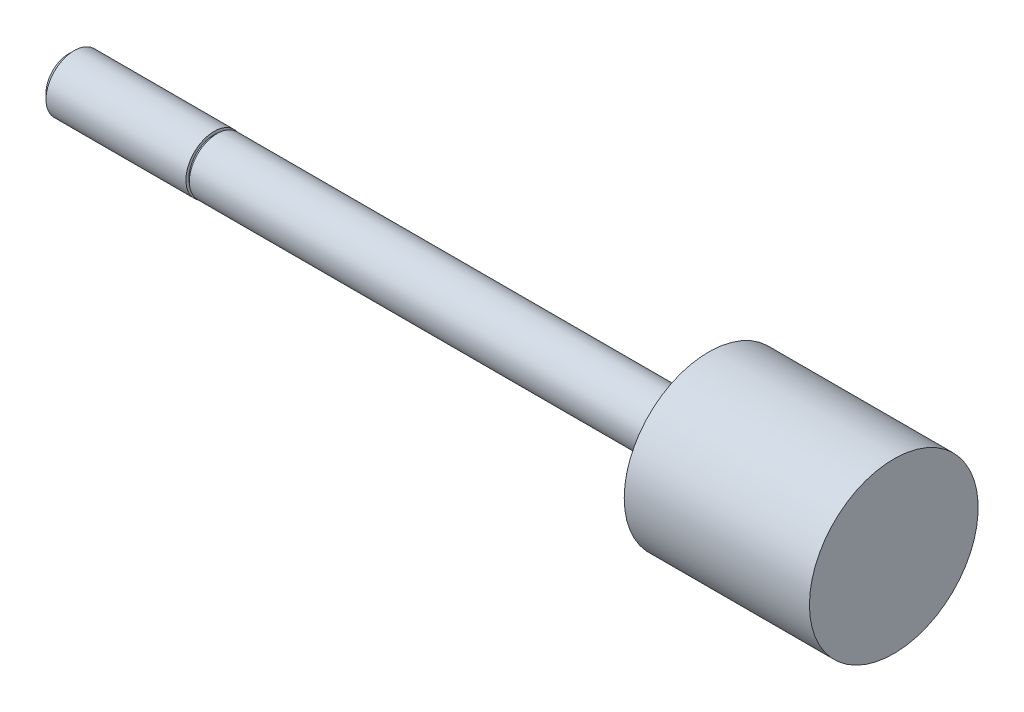
ISO-10303-21;
HEADER;
FILE_DESCRIPTION(('STEP AP214'),'2;1');
FILE_NAME('part.step','',(''),(''),'','','');
FILE_SCHEMA(('AUTOMOTIVE_DESIGN { 1 0 10303 214 1 1 1 1 }'));
ENDSEC;
DATA;
#1=APPLICATION_CONTEXT('core data for automotive mechanical design processes');
#2=APPLICATION_PROTOCOL_DEFINITION('international standard','automotive_design',2000,#1);
#3=PRODUCT_CONTEXT('',#1,'mechanical');
#4=PRODUCT('Part','Part','',(#3));
#5=PRODUCT_RELATED_PRODUCT_CATEGORY('part','',(#4));
#6=PRODUCT_DEFINITION_FORMATION('','',#4);
#7=PRODUCT_DEFINITION_CONTEXT('part definition',#1,'design');
#8=PRODUCT_DEFINITION('design','',#6,#7);
#9=PRODUCT_DEFINITION_SHAPE('','',#8);
#10=(LENGTH_UNIT() NAMED_UNIT(*) SI_UNIT(.MILLI.,.METRE.));
#11=(NAMED_UNIT(*) PLANE_ANGLE_UNIT() SI_UNIT($,.RADIAN.));
#12=(NAMED_UNIT(*) SI_UNIT($,.STERADIAN.) SOLID_ANGLE_UNIT());
#13=UNCERTAINTY_MEASURE_WITH_UNIT(LENGTH_MEASURE(1.E-05),#10,'distance_accuracy_value','');
#14=(GEOMETRIC_REPRESENTATION_CONTEXT(3) GLOBAL_UNCERTAINTY_ASSIGNED_CONTEXT((#13)) GLOBAL_UNIT_ASSIGNED_CONTEXT((#10,
#11,#12)) REPRESENTATION_CONTEXT('',''));
#15=CARTESIAN_POINT('',(0.,0.,0.));
#16=DIRECTION('',(0.,0.,1.));
#17=DIRECTION('',(1.,0.,0.));
#18=AXIS2_PLACEMENT_3D('',#15,#16,#17);
#19=CARTESIAN_POINT('',(57.912,0.,0.));
#20=DIRECTION('',(-1.,0.,0.));
#21=DIRECTION('',(0.,0.,1.));
#22=AXIS2_PLACEMENT_3D('',#19,#20,#21);
#23=CYLINDRICAL_SURFACE('',#22,2.3749);
#24=CARTESIAN_POINT('',(0.,0.,0.));
#25=DIRECTION('',(-1.,0.,0.));
#26=DIRECTION('',(0.,0.,1.));
#27=AXIS2_PLACEMENT_3D('',#24,#25,#26);
#28=CIRCLE('',#27,2.3749);
#29=CARTESIAN_POINT('',(0.,0.,2.3749));
#30=VERTEX_POINT('',#29);
#31=EDGE_CURVE('E56',#30,#30,#28,.T.);
#32=ORIENTED_EDGE('',*,*,#31,.F.);
#33=EDGE_LOOP('',(#32));
#34=FACE_BOUND('',#33,.T.);
#35=CARTESIAN_POINT('',(42.0624,0.,0.));
#36=DIRECTION('',(-1.,0.,0.));
#37=DIRECTION('',(0.,0.,1.));
#38=AXIS2_PLACEMENT_3D('',#35,#36,#37);
#39=CIRCLE('',#38,2.3749);
#40=CARTESIAN_POINT('',(42.0624,0.,2.3749));
#41=VERTEX_POINT('',#40);
#42=EDGE_CURVE('E10',#41,#41,#39,.T.);
#43=ORIENTED_EDGE('',*,*,#42,.T.);
#44=EDGE_LOOP('',(#43));
#45=FACE_BOUND('',#44,.T.);
#46=ADVANCED_FACE('F34',(#34,#45),#23,.T.);
#47=CARTESIAN_POINT('',(42.0624,2.3749,0.));
#48=DIRECTION('',(1.,0.,0.));
#49=DIRECTION('',(0.,0.,-1.));
#50=AXIS2_PLACEMENT_3D('',#47,#48,#49);
#51=PLANE('',#50);
#52=ORIENTED_EDGE('',*,*,#42,.F.);
#53=EDGE_LOOP('',(#52));
#54=FACE_BOUND('',#53,.T.);
#55=CARTESIAN_POINT('',(42.0624,0.,0.));
#56=DIRECTION('',(-1.,0.,0.));
#57=DIRECTION('',(0.,0.,1.));
#58=AXIS2_PLACEMENT_3D('',#55,#56,#57);
#59=CIRCLE('',#58,7.21995);
#60=CARTESIAN_POINT('',(42.0624,0.,7.21995));
#61=VERTEX_POINT('',#60);
#62=EDGE_CURVE('E41',#61,#61,#59,.T.);
#63=ORIENTED_EDGE('',*,*,#62,.T.);
#64=EDGE_LOOP('',(#63));
#65=FACE_BOUND('',#64,.T.);
#66=ADVANCED_FACE('F77',(#54,#65),#51,.F.);
#67=CARTESIAN_POINT('',(57.912,0.,0.));
#68=DIRECTION('',(-1.,0.,0.));
#69=DIRECTION('',(0.,0.,1.));
#70=AXIS2_PLACEMENT_3D('',#67,#68,#69);
#71=CYLINDRICAL_SURFACE('',#70,7.21995);
#72=ORIENTED_EDGE('',*,*,#62,.F.);
#73=EDGE_LOOP('',(#72));
#74=FACE_BOUND('',#73,.T.);
#75=CARTESIAN_POINT('',(57.912,0.,0.));
#76=DIRECTION('',(-1.,0.,0.));
#77=DIRECTION('',(0.,0.,1.));
#78=AXIS2_PLACEMENT_3D('',#75,#76,#77);
#79=CIRCLE('',#78,7.21995);
#80=CARTESIAN_POINT('',(57.912,0.,7.21995));
#81=VERTEX_POINT('',#80);
#82=EDGE_CURVE('E45',#81,#81,#79,.T.);
#83=ORIENTED_EDGE('',*,*,#82,.T.);
#84=EDGE_LOOP('',(#83));
#85=FACE_BOUND('',#84,.T.);
#86=ADVANCED_FACE('F81',(#74,#85),#71,.T.);
#87=CARTESIAN_POINT('',(57.912,7.21995,0.));
#88=DIRECTION('',(-1.,0.,0.));
#89=DIRECTION('',(0.,0.,1.));
#90=AXIS2_PLACEMENT_3D('',#87,#88,#89);
#91=PLANE('',#90);
#92=ORIENTED_EDGE('',*,*,#82,.F.);
#93=EDGE_LOOP('',(#92));
#94=FACE_BOUND('',#93,.T.);
#95=ADVANCED_FACE('F86',(#94),#91,.F.);
#96=CARTESIAN_POINT('',(-0.254,2.667,0.));
#97=DIRECTION('',(1.,0.,0.));
#98=DIRECTION('',(0.,0.,-1.));
#99=AXIS2_PLACEMENT_3D('',#96,#97,#98);
#100=PLANE('',#99);
#101=CARTESIAN_POINT('',(-0.254,0.,0.));
#102=DIRECTION('',(-1.,0.,0.));
#103=DIRECTION('',(0.,0.,1.));
#104=AXIS2_PLACEMENT_3D('',#101,#102,#103);
#105=CIRCLE('',#104,2.159);
#106=CARTESIAN_POINT('',(-0.254,0.,2.159));
#107=VERTEX_POINT('',#106);
#108=EDGE_CURVE('E59',#107,#107,#105,.T.);
#109=ORIENTED_EDGE('',*,*,#108,.T.);
#110=EDGE_LOOP('',(#109));
#111=FACE_BOUND('',#110,.T.);
#112=CARTESIAN_POINT('',(-0.254,0.,0.));
#113=DIRECTION('',(1.,0.,0.));
#114=DIRECTION('',(0.,0.,-1.));
#115=AXIS2_PLACEMENT_3D('',#112,#113,#114);
#116=CIRCLE('',#115,2.413);
#117=CARTESIAN_POINT('',(-0.254,0.,-2.413));
#118=VERTEX_POINT('',#117);
#119=EDGE_CURVE('E37',#118,#118,#116,.T.);
#120=ORIENTED_EDGE('',*,*,#119,.T.);
#121=EDGE_LOOP('',(#120));
#122=FACE_BOUND('',#121,.T.);
#123=ADVANCED_FACE('F72',(#111,#122),#100,.T.);
#124=CARTESIAN_POINT('',(0.,2.159,0.));
#125=DIRECTION('',(-1.,0.,0.));
#126=DIRECTION('',(0.,0.,1.));
#127=AXIS2_PLACEMENT_3D('',#124,#125,#126);
#128=PLANE('',#127);
#129=CARTESIAN_POINT('',(0.,0.,0.));
#130=DIRECTION('',(-1.,0.,0.));
#131=DIRECTION('',(0.,0.,1.));
#132=AXIS2_PLACEMENT_3D('',#129,#130,#131);
#133=CIRCLE('',#132,2.159);
#134=CARTESIAN_POINT('',(0.,0.,2.159));
#135=VERTEX_POINT('',#134);
#136=EDGE_CURVE('E62',#135,#135,#133,.T.);
#137=ORIENTED_EDGE('',*,*,#136,.F.);
#138=EDGE_LOOP('',(#137));
#139=FACE_BOUND('',#138,.T.);
#140=ORIENTED_EDGE('',*,*,#31,.T.);
#141=EDGE_LOOP('',(#140));
#142=FACE_BOUND('',#141,.T.);
#143=ADVANCED_FACE('F69',(#139,#142),#128,.T.);
#144=CARTESIAN_POINT('',(0.,0.,0.));
#145=DIRECTION('',(-1.,0.,0.));
#146=DIRECTION('',(0.,0.,1.));
#147=AXIS2_PLACEMENT_3D('',#144,#145,#146);
#148=CYLINDRICAL_SURFACE('',#147,2.159);
#149=ORIENTED_EDGE('',*,*,#136,.T.);
#150=EDGE_LOOP('',(#149));
#151=FACE_BOUND('',#150,.T.);
#152=ORIENTED_EDGE('',*,*,#108,.F.);
#153=EDGE_LOOP('',(#152));
#154=FACE_BOUND('',#153,.T.);
#155=ADVANCED_FACE('F66',(#151,#154),#148,.T.);
#156=CARTESIAN_POINT('',(-12.7,0.,0.));
#157=DIRECTION('',(1.,0.,0.));
#158=DIRECTION('',(0.,0.,-1.));
#159=AXIS2_PLACEMENT_3D('',#156,#157,#158);
#160=PLANE('',#159);
#161=CARTESIAN_POINT('',(-12.7,0.,0.));
#162=DIRECTION('',(-1.,0.,0.));
#163=DIRECTION('',(0.,0.,1.));
#164=AXIS2_PLACEMENT_3D('',#161,#162,#163);
#165=CIRCLE('',#164,1.94056);
#166=CARTESIAN_POINT('',(-12.7,0.,1.94056));
#167=VERTEX_POINT('',#166);
#168=EDGE_CURVE('E50',#167,#167,#165,.T.);
#169=ORIENTED_EDGE('',*,*,#168,.T.);
#170=EDGE_LOOP('',(#169));
#171=FACE_BOUND('',#170,.T.);
#172=ADVANCED_FACE('F94',(#171),#160,.F.);
#173=CARTESIAN_POINT('',(-12.22756,0.,0.));
#174=DIRECTION('',(1.,0.,0.));
#175=DIRECTION('',(0.,0.,-1.));
#176=AXIS2_PLACEMENT_3D('',#173,#174,#175);
#177=CONICAL_SURFACE('',#176,2.413,0.785398163397449);
#178=ORIENTED_EDGE('',*,*,#168,.F.);
#179=EDGE_LOOP('',(#178));
#180=FACE_BOUND('',#179,.T.);
#181=CARTESIAN_POINT('',(-12.22756,0.,0.));
#182=DIRECTION('',(-1.,0.,0.));
#183=DIRECTION('',(0.,0.,1.));
#184=AXIS2_PLACEMENT_3D('',#181,#182,#183);
#185=CIRCLE('',#184,2.413);
#186=CARTESIAN_POINT('',(-12.22756,0.,2.413));
#187=VERTEX_POINT('',#186);
#188=EDGE_CURVE('E53',#187,#187,#185,.T.);
#189=ORIENTED_EDGE('',*,*,#188,.T.);
#190=EDGE_LOOP('',(#189));
#191=FACE_BOUND('',#190,.T.);
#192=ADVANCED_FACE('F97',(#180,#191),#177,.T.);
#193=CARTESIAN_POINT('',(0.,0.,0.));
#194=DIRECTION('',(-1.,0.,0.));
#195=DIRECTION('',(0.,0.,1.));
#196=AXIS2_PLACEMENT_3D('',#193,#194,#195);
#197=CYLINDRICAL_SURFACE('',#196,2.413);
#198=ORIENTED_EDGE('',*,*,#188,.F.);
#199=EDGE_LOOP('',(#198));
#200=FACE_BOUND('',#199,.T.);
#201=ORIENTED_EDGE('',*,*,#119,.F.);
#202=EDGE_LOOP('',(#201));
#203=FACE_BOUND('',#202,.T.);
#204=ADVANCED_FACE('F101',(#200,#203),#197,.T.);
#205=CLOSED_SHELL('',(#46,#66,#86,#95,#123,#143,#155,#172,#192,#204));
#206=MANIFOLD_SOLID_BREP('B2',#205);
#207=ADVANCED_BREP_SHAPE_REPRESENTATION('',(#18,#206),#14);
#208=SHAPE_DEFINITION_REPRESENTATION(#9,#207);
ENDSEC;
END-ISO-10303-21;
